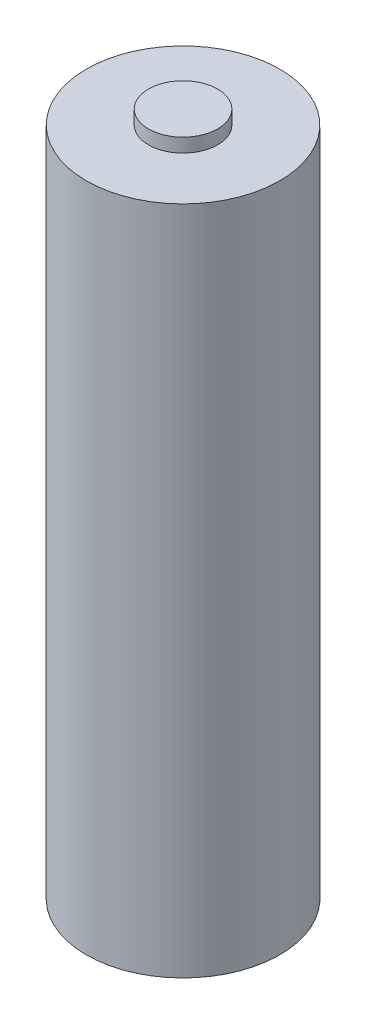
ISO-10303-21;
HEADER;
FILE_DESCRIPTION(('STEP AP214'),'2;1');
FILE_NAME('part.step','',(''),(''),'','','');
FILE_SCHEMA(('AUTOMOTIVE_DESIGN { 1 0 10303 214 1 1 1 1 }'));
ENDSEC;
DATA;
#1=APPLICATION_CONTEXT('core data for automotive mechanical design processes');
#2=APPLICATION_PROTOCOL_DEFINITION('international standard','automotive_design',2000,#1);
#3=PRODUCT_CONTEXT('',#1,'mechanical');
#4=PRODUCT('Part','Part','',(#3));
#5=PRODUCT_RELATED_PRODUCT_CATEGORY('part','',(#4));
#6=PRODUCT_DEFINITION_FORMATION('','',#4);
#7=PRODUCT_DEFINITION_CONTEXT('part definition',#1,'design');
#8=PRODUCT_DEFINITION('design','',#6,#7);
#9=PRODUCT_DEFINITION_SHAPE('','',#8);
#10=(LENGTH_UNIT() NAMED_UNIT(*) SI_UNIT(.MILLI.,.METRE.));
#11=(NAMED_UNIT(*) PLANE_ANGLE_UNIT() SI_UNIT($,.RADIAN.));
#12=(NAMED_UNIT(*) SI_UNIT($,.STERADIAN.) SOLID_ANGLE_UNIT());
#13=UNCERTAINTY_MEASURE_WITH_UNIT(LENGTH_MEASURE(1.E-05),#10,'distance_accuracy_value','');
#14=(GEOMETRIC_REPRESENTATION_CONTEXT(3) GLOBAL_UNCERTAINTY_ASSIGNED_CONTEXT((#13)) GLOBAL_UNIT_ASSIGNED_CONTEXT((#10,
#11,#12)) REPRESENTATION_CONTEXT('',''));
#15=CARTESIAN_POINT('',(0.,0.,0.));
#16=DIRECTION('',(0.,0.,1.));
#17=DIRECTION('',(1.,0.,0.));
#18=AXIS2_PLACEMENT_3D('',#15,#16,#17);
#19=CARTESIAN_POINT('',(0.,48.5,0.));
#20=DIRECTION('',(0.,-1.,0.));
#21=DIRECTION('',(0.,0.,-1.));
#22=AXIS2_PLACEMENT_3D('',#19,#20,#21);
#23=CYLINDRICAL_SURFACE('',#22,7.);
#24=CARTESIAN_POINT('',(0.,48.5,0.));
#25=DIRECTION('',(0.,1.,0.));
#26=DIRECTION('',(0.,0.,1.));
#27=AXIS2_PLACEMENT_3D('',#24,#25,#26);
#28=CIRCLE('',#27,7.);
#29=CARTESIAN_POINT('',(0.,48.5,7.));
#30=VERTEX_POINT('',#29);
#31=EDGE_CURVE('E10',#30,#30,#28,.T.);
#32=ORIENTED_EDGE('',*,*,#31,.F.);
#33=EDGE_LOOP('',(#32));
#34=FACE_BOUND('',#33,.T.);
#35=CARTESIAN_POINT('',(0.,0.,0.));
#36=DIRECTION('',(0.,1.,0.));
#37=DIRECTION('',(0.,0.,1.));
#38=AXIS2_PLACEMENT_3D('',#35,#36,#37);
#39=CIRCLE('',#38,7.);
#40=CARTESIAN_POINT('',(0.,0.,7.));
#41=VERTEX_POINT('',#40);
#42=EDGE_CURVE('E36',#41,#41,#39,.T.);
#43=ORIENTED_EDGE('',*,*,#42,.T.);
#44=EDGE_LOOP('',(#43));
#45=FACE_BOUND('',#44,.T.);
#46=ADVANCED_FACE('F33',(#34,#45),#23,.T.);
#47=CARTESIAN_POINT('',(0.,48.5,0.));
#48=DIRECTION('',(0.,1.,0.));
#49=DIRECTION('',(0.,0.,1.));
#50=AXIS2_PLACEMENT_3D('',#47,#48,#49);
#51=PLANE('',#50);
#52=CARTESIAN_POINT('',(0.,48.5,0.));
#53=DIRECTION('',(0.,1.,0.));
#54=DIRECTION('',(0.,0.,1.));
#55=AXIS2_PLACEMENT_3D('',#52,#53,#54);
#56=CIRCLE('',#55,2.5);
#57=CARTESIAN_POINT('',(0.,48.5,2.5));
#58=VERTEX_POINT('',#57);
#59=EDGE_CURVE('E45',#58,#58,#56,.T.);
#60=ORIENTED_EDGE('',*,*,#59,.F.);
#61=EDGE_LOOP('',(#60));
#62=FACE_BOUND('',#61,.T.);
#63=ORIENTED_EDGE('',*,*,#31,.T.);
#64=EDGE_LOOP('',(#63));
#65=FACE_BOUND('',#64,.T.);
#66=ADVANCED_FACE('F70',(#62,#65),#51,.T.);
#67=CARTESIAN_POINT('',(0.,0.,0.));
#68=DIRECTION('',(0.,1.,0.));
#69=DIRECTION('',(0.,0.,1.));
#70=AXIS2_PLACEMENT_3D('',#67,#68,#69);
#71=PLANE('',#70);
#72=CARTESIAN_POINT('',(0.,0.,0.));
#73=DIRECTION('',(0.,-1.,0.));
#74=DIRECTION('',(0.,0.,-1.));
#75=AXIS2_PLACEMENT_3D('',#72,#73,#74);
#76=CIRCLE('',#75,3.5);
#77=CARTESIAN_POINT('',(0.,0.,-3.5));
#78=VERTEX_POINT('',#77);
#79=EDGE_CURVE('E51',#78,#78,#76,.T.);
#80=ORIENTED_EDGE('',*,*,#79,.F.);
#81=EDGE_LOOP('',(#80));
#82=FACE_BOUND('',#81,.T.);
#83=ORIENTED_EDGE('',*,*,#42,.F.);
#84=EDGE_LOOP('',(#83));
#85=FACE_BOUND('',#84,.T.);
#86=ADVANCED_FACE('F66',(#82,#85),#71,.F.);
#87=CARTESIAN_POINT('',(0.,49.5,0.));
#88=DIRECTION('',(0.,-1.,0.));
#89=DIRECTION('',(0.,0.,-1.));
#90=AXIS2_PLACEMENT_3D('',#87,#88,#89);
#91=CYLINDRICAL_SURFACE('',#90,2.5);
#92=CARTESIAN_POINT('',(0.,49.5,0.));
#93=DIRECTION('',(0.,1.,0.));
#94=DIRECTION('',(0.,0.,1.));
#95=AXIS2_PLACEMENT_3D('',#92,#93,#94);
#96=CIRCLE('',#95,2.5);
#97=CARTESIAN_POINT('',(0.,49.5,2.5));
#98=VERTEX_POINT('',#97);
#99=EDGE_CURVE('E43',#98,#98,#96,.T.);
#100=ORIENTED_EDGE('',*,*,#99,.F.);
#101=EDGE_LOOP('',(#100));
#102=FACE_BOUND('',#101,.T.);
#103=ORIENTED_EDGE('',*,*,#59,.T.);
#104=EDGE_LOOP('',(#103));
#105=FACE_BOUND('',#104,.T.);
#106=ADVANCED_FACE('F69',(#102,#105),#91,.T.);
#107=CARTESIAN_POINT('',(0.,49.5,0.));
#108=DIRECTION('',(0.,1.,0.));
#109=DIRECTION('',(0.,0.,1.));
#110=AXIS2_PLACEMENT_3D('',#107,#108,#109);
#111=PLANE('',#110);
#112=ORIENTED_EDGE('',*,*,#99,.T.);
#113=EDGE_LOOP('',(#112));
#114=FACE_BOUND('',#113,.T.);
#115=ADVANCED_FACE('F62',(#114),#111,.T.);
#116=CARTESIAN_POINT('',(0.,0.01,0.));
#117=DIRECTION('',(0.,-1.,0.));
#118=DIRECTION('',(0.,0.,-1.));
#119=AXIS2_PLACEMENT_3D('',#116,#117,#118);
#120=CYLINDRICAL_SURFACE('',#119,3.5);
#121=CARTESIAN_POINT('',(0.,0.01,0.));
#122=DIRECTION('',(0.,-1.,0.));
#123=DIRECTION('',(0.,0.,-1.));
#124=AXIS2_PLACEMENT_3D('',#121,#122,#123);
#125=CIRCLE('',#124,3.5);
#126=CARTESIAN_POINT('',(0.,0.01,-3.5));
#127=VERTEX_POINT('',#126);
#128=EDGE_CURVE('E48',#127,#127,#125,.T.);
#129=ORIENTED_EDGE('',*,*,#128,.F.);
#130=EDGE_LOOP('',(#129));
#131=FACE_BOUND('',#130,.T.);
#132=ORIENTED_EDGE('',*,*,#79,.T.);
#133=EDGE_LOOP('',(#132));
#134=FACE_BOUND('',#133,.T.);
#135=ADVANCED_FACE('F59',(#131,#134),#120,.F.);
#136=CARTESIAN_POINT('',(0.,0.01,0.));
#137=DIRECTION('',(0.,-1.,0.));
#138=DIRECTION('',(0.,0.,-1.));
#139=AXIS2_PLACEMENT_3D('',#136,#137,#138);
#140=PLANE('',#139);
#141=ORIENTED_EDGE('',*,*,#128,.T.);
#142=EDGE_LOOP('',(#141));
#143=FACE_BOUND('',#142,.T.);
#144=ADVANCED_FACE('F57',(#143),#140,.T.);
#145=CLOSED_SHELL('',(#46,#66,#86,#106,#115,#135,#144));
#146=MANIFOLD_SOLID_BREP('B2',#145);
#147=ADVANCED_BREP_SHAPE_REPRESENTATION('',(#18,#146),#14);
#148=SHAPE_DEFINITION_REPRESENTATION(#9,#147);
ENDSEC;
END-ISO-10303-21;
